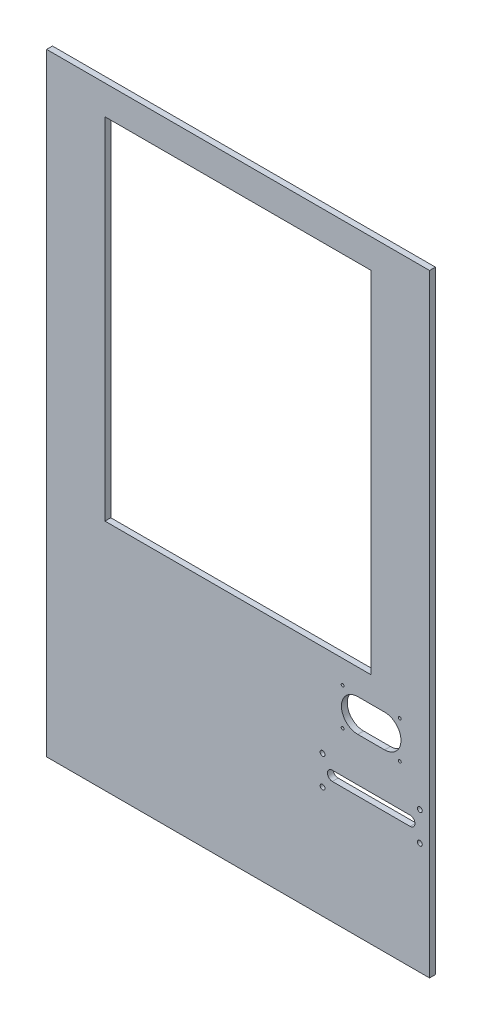
ISO-10303-21;
HEADER;
FILE_DESCRIPTION(('STEP AP214'),'2;1');
FILE_NAME('part.step','',(''),(''),'','','');
FILE_SCHEMA(('AUTOMOTIVE_DESIGN { 1 0 10303 214 1 1 1 1 }'));
ENDSEC;
DATA;
#1=APPLICATION_CONTEXT('core data for automotive mechanical design processes');
#2=APPLICATION_PROTOCOL_DEFINITION('international standard','automotive_design',2000,#1);
#3=PRODUCT_CONTEXT('',#1,'mechanical');
#4=PRODUCT('Part','Part','',(#3));
#5=PRODUCT_RELATED_PRODUCT_CATEGORY('part','',(#4));
#6=PRODUCT_DEFINITION_FORMATION('','',#4);
#7=PRODUCT_DEFINITION_CONTEXT('part definition',#1,'design');
#8=PRODUCT_DEFINITION('design','',#6,#7);
#9=PRODUCT_DEFINITION_SHAPE('','',#8);
#10=(LENGTH_UNIT() NAMED_UNIT(*) SI_UNIT(.MILLI.,.METRE.));
#11=(NAMED_UNIT(*) PLANE_ANGLE_UNIT() SI_UNIT($,.RADIAN.));
#12=(NAMED_UNIT(*) SI_UNIT($,.STERADIAN.) SOLID_ANGLE_UNIT());
#13=UNCERTAINTY_MEASURE_WITH_UNIT(LENGTH_MEASURE(1.E-05),#10,'distance_accuracy_value','');
#14=(GEOMETRIC_REPRESENTATION_CONTEXT(3) GLOBAL_UNCERTAINTY_ASSIGNED_CONTEXT((#13)) GLOBAL_UNIT_ASSIGNED_CONTEXT((#10,
#11,#12)) REPRESENTATION_CONTEXT('',''));
#15=CARTESIAN_POINT('',(0.,0.,0.));
#16=DIRECTION('',(0.,0.,1.));
#17=DIRECTION('',(1.,0.,0.));
#18=AXIS2_PLACEMENT_3D('',#15,#16,#17);
#19=CARTESIAN_POINT('',(0.,0.,7.62));
#20=DIRECTION('',(0.,0.,1.));
#21=DIRECTION('',(1.,0.,0.));
#22=AXIS2_PLACEMENT_3D('',#19,#20,#21);
#23=PLANE('',#22);
#24=CARTESIAN_POINT('',(237.3,-253.95,7.62));
#25=DIRECTION('',(0.,0.,1.));
#26=DIRECTION('',(-1.,0.,0.));
#27=AXIS2_PLACEMENT_3D('',#24,#25,#26);
#28=CIRCLE('',#27,3.175);
#29=CARTESIAN_POINT('',(234.125,-253.95,7.62));
#30=VERTEX_POINT('',#29);
#31=EDGE_CURVE('E562',#30,#30,#28,.T.);
#32=ORIENTED_EDGE('',*,*,#31,.F.);
#33=EDGE_LOOP('',(#32));
#34=FACE_BOUND('',#33,.T.);
#35=CARTESIAN_POINT('',(237.3,-215.85,7.62));
#36=DIRECTION('',(0.,0.,1.));
#37=DIRECTION('',(1.,0.,0.));
#38=AXIS2_PLACEMENT_3D('',#35,#36,#37);
#39=CIRCLE('',#38,3.175);
#40=CARTESIAN_POINT('',(240.475,-215.85,7.62));
#41=VERTEX_POINT('',#40);
#42=EDGE_CURVE('E175',#41,#41,#39,.T.);
#43=ORIENTED_EDGE('',*,*,#42,.F.);
#44=EDGE_LOOP('',(#43));
#45=FACE_BOUND('',#44,.T.);
#46=CARTESIAN_POINT('',(211.138,-174.448,7.62));
#47=DIRECTION('',(0.,0.,1.));
#48=DIRECTION('',(1.,0.,0.));
#49=AXIS2_PLACEMENT_3D('',#46,#47,#48);
#50=CIRCLE('',#49,1.90499999999999);
#51=CARTESIAN_POINT('',(213.043,-174.448,7.62));
#52=VERTEX_POINT('',#51);
#53=EDGE_CURVE('E191',#52,#52,#50,.T.);
#54=ORIENTED_EDGE('',*,*,#53,.F.);
#55=EDGE_LOOP('',(#54));
#56=FACE_BOUND('',#55,.T.);
#57=CARTESIAN_POINT('',(136.462,-125.68,7.62));
#58=DIRECTION('',(0.,0.,1.));
#59=DIRECTION('',(1.,0.,0.));
#60=AXIS2_PLACEMENT_3D('',#57,#58,#59);
#61=CIRCLE('',#60,1.90499999999999);
#62=CARTESIAN_POINT('',(138.367,-125.68,7.62));
#63=VERTEX_POINT('',#62);
#64=EDGE_CURVE('E203',#63,#63,#61,.T.);
#65=ORIENTED_EDGE('',*,*,#64,.F.);
#66=EDGE_LOOP('',(#65));
#67=FACE_BOUND('',#66,.T.);
#68=DIRECTION('',(0.,1.,0.));
#69=VECTOR('',#68,1.);
#70=CARTESIAN_POINT('',(250.,400.,7.62));
#71=LINE('',#70,#69);
#72=CARTESIAN_POINT('',(250.,-400.,7.62));
#73=VERTEX_POINT('',#72);
#74=CARTESIAN_POINT('',(250.,400.,7.62));
#75=VERTEX_POINT('',#74);
#76=EDGE_CURVE('E271',#73,#75,#71,.T.);
#77=ORIENTED_EDGE('',*,*,#76,.T.);
#78=DIRECTION('',(-1.,0.,0.));
#79=VECTOR('',#78,1.);
#80=CARTESIAN_POINT('',(-250.,400.,7.62));
#81=LINE('',#80,#79);
#82=CARTESIAN_POINT('',(-250.,400.,7.62));
#83=VERTEX_POINT('',#82);
#84=EDGE_CURVE('E274',#75,#83,#81,.T.);
#85=ORIENTED_EDGE('',*,*,#84,.T.);
#86=DIRECTION('',(0.,-1.,0.));
#87=VECTOR('',#86,1.);
#88=CARTESIAN_POINT('',(-250.,400.,7.62));
#89=LINE('',#88,#87);
#90=CARTESIAN_POINT('',(-250.,-400.,7.62));
#91=VERTEX_POINT('',#90);
#92=EDGE_CURVE('E277',#83,#91,#89,.T.);
#93=ORIENTED_EDGE('',*,*,#92,.T.);
#94=DIRECTION('',(1.,0.,0.));
#95=VECTOR('',#94,1.);
#96=CARTESIAN_POINT('',(-250.,-400.,7.62));
#97=LINE('',#96,#95);
#98=EDGE_CURVE('E279',#91,#73,#97,.T.);
#99=ORIENTED_EDGE('',*,*,#98,.T.);
#100=EDGE_LOOP('',(#77,#85,#93,#99));
#101=FACE_BOUND('',#100,.T.);
#102=DIRECTION('',(-1.,0.,0.));
#103=VECTOR('',#102,1.);
#104=CARTESIAN_POINT('',(-173.8,361.9,7.62));
#105=LINE('',#104,#103);
#106=CARTESIAN_POINT('',(173.8,361.9,7.62));
#107=VERTEX_POINT('',#106);
#108=CARTESIAN_POINT('',(-173.8,361.9,7.62));
#109=VERTEX_POINT('',#108);
#110=EDGE_CURVE('E242',#107,#109,#105,.T.);
#111=ORIENTED_EDGE('',*,*,#110,.F.);
#112=DIRECTION('',(0.,1.,0.));
#113=VECTOR('',#112,1.);
#114=CARTESIAN_POINT('',(173.8,361.9,7.62));
#115=LINE('',#114,#113);
#116=CARTESIAN_POINT('',(173.8,-95.3000000000001,7.62));
#117=VERTEX_POINT('',#116);
#118=EDGE_CURVE('E240',#117,#107,#115,.T.);
#119=ORIENTED_EDGE('',*,*,#118,.F.);
#120=DIRECTION('',(1.,0.,0.));
#121=VECTOR('',#120,1.);
#122=CARTESIAN_POINT('',(-173.8,-95.3000000000001,7.62));
#123=LINE('',#122,#121);
#124=CARTESIAN_POINT('',(-173.8,-95.3000000000001,7.62));
#125=VERTEX_POINT('',#124);
#126=EDGE_CURVE('E248',#125,#117,#123,.T.);
#127=ORIENTED_EDGE('',*,*,#126,.F.);
#128=DIRECTION('',(0.,-1.,0.));
#129=VECTOR('',#128,1.);
#130=CARTESIAN_POINT('',(-173.8,361.9,7.62));
#131=LINE('',#130,#129);
#132=EDGE_CURVE('E245',#109,#125,#131,.T.);
#133=ORIENTED_EDGE('',*,*,#132,.F.);
#134=EDGE_LOOP('',(#111,#119,#127,#133));
#135=FACE_BOUND('',#134,.T.);
#136=DIRECTION('',(-1.,0.,0.));
#137=VECTOR('',#136,1.);
#138=CARTESIAN_POINT('',(156.274,-128.728,7.62));
#139=LINE('',#138,#137);
#140=CARTESIAN_POINT('',(191.326,-128.728,7.62));
#141=VERTEX_POINT('',#140);
#142=CARTESIAN_POINT('',(156.274,-128.728,7.62));
#143=VERTEX_POINT('',#142);
#144=EDGE_CURVE('E211',#141,#143,#139,.T.);
#145=ORIENTED_EDGE('',*,*,#144,.F.);
#146=CARTESIAN_POINT('',(191.326,-150.064,7.62));
#147=DIRECTION('',(0.,0.,1.));
#148=DIRECTION('',(-1.,0.,0.));
#149=AXIS2_PLACEMENT_3D('',#146,#147,#148);
#150=CIRCLE('',#149,21.336);
#151=CARTESIAN_POINT('',(191.326,-171.4,7.62));
#152=VERTEX_POINT('',#151);
#153=EDGE_CURVE('E209',#152,#141,#150,.T.);
#154=ORIENTED_EDGE('',*,*,#153,.F.);
#155=DIRECTION('',(1.,0.,0.));
#156=VECTOR('',#155,1.);
#157=CARTESIAN_POINT('',(156.274,-171.4,7.62));
#158=LINE('',#157,#156);
#159=CARTESIAN_POINT('',(156.274,-171.4,7.62));
#160=VERTEX_POINT('',#159);
#161=EDGE_CURVE('E217',#160,#152,#158,.T.);
#162=ORIENTED_EDGE('',*,*,#161,.F.);
#163=CARTESIAN_POINT('',(156.274,-150.064,7.62));
#164=DIRECTION('',(0.,0.,1.));
#165=DIRECTION('',(1.,0.,0.));
#166=AXIS2_PLACEMENT_3D('',#163,#164,#165);
#167=CIRCLE('',#166,21.336);
#168=EDGE_CURVE('E214',#143,#160,#167,.T.);
#169=ORIENTED_EDGE('',*,*,#168,.F.);
#170=EDGE_LOOP('',(#145,#154,#162,#169));
#171=FACE_BOUND('',#170,.T.);
#172=CARTESIAN_POINT('',(211.138,-125.68,7.62));
#173=DIRECTION('',(0.,0.,1.));
#174=DIRECTION('',(-1.,0.,0.));
#175=AXIS2_PLACEMENT_3D('',#172,#173,#174);
#176=CIRCLE('',#175,1.90499999999999);
#177=CARTESIAN_POINT('',(209.233,-125.68,7.62));
#178=VERTEX_POINT('',#177);
#179=EDGE_CURVE('E197',#178,#178,#176,.T.);
#180=ORIENTED_EDGE('',*,*,#179,.F.);
#181=EDGE_LOOP('',(#180));
#182=FACE_BOUND('',#181,.T.);
#183=CARTESIAN_POINT('',(136.462,-174.448,7.62));
#184=DIRECTION('',(0.,0.,1.));
#185=DIRECTION('',(-1.,0.,0.));
#186=AXIS2_PLACEMENT_3D('',#183,#184,#185);
#187=CIRCLE('',#186,1.90499999999999);
#188=CARTESIAN_POINT('',(134.557,-174.448,7.62));
#189=VERTEX_POINT('',#188);
#190=EDGE_CURVE('E185',#189,#189,#187,.T.);
#191=ORIENTED_EDGE('',*,*,#190,.F.);
#192=EDGE_LOOP('',(#191));
#193=FACE_BOUND('',#192,.T.);
#194=DIRECTION('',(-1.,0.,0.));
#195=VECTOR('',#194,1.);
#196=CARTESIAN_POINT('',(224.6,-228.55,7.62));
#197=LINE('',#196,#195);
#198=CARTESIAN_POINT('',(224.6,-228.55,7.62));
#199=VERTEX_POINT('',#198);
#200=CARTESIAN_POINT('',(123.,-228.55,7.62));
#201=VERTEX_POINT('',#200);
#202=EDGE_CURVE('E154',#199,#201,#197,.T.);
#203=ORIENTED_EDGE('',*,*,#202,.F.);
#204=CARTESIAN_POINT('',(224.6,-234.9,7.62));
#205=DIRECTION('',(0.,0.,1.));
#206=DIRECTION('',(1.,0.,0.));
#207=AXIS2_PLACEMENT_3D('',#204,#205,#206);
#208=CIRCLE('',#207,6.35000000000002);
#209=CARTESIAN_POINT('',(224.6,-241.25,7.62));
#210=VERTEX_POINT('',#209);
#211=EDGE_CURVE('E146',#210,#199,#208,.T.);
#212=ORIENTED_EDGE('',*,*,#211,.F.);
#213=DIRECTION('',(1.,0.,0.));
#214=VECTOR('',#213,1.);
#215=CARTESIAN_POINT('',(224.6,-241.25,7.62));
#216=LINE('',#215,#214);
#217=CARTESIAN_POINT('',(123.,-241.25,7.62));
#218=VERTEX_POINT('',#217);
#219=EDGE_CURVE('E169',#218,#210,#216,.T.);
#220=ORIENTED_EDGE('',*,*,#219,.F.);
#221=CARTESIAN_POINT('',(123.,-234.9,7.62));
#222=DIRECTION('',(0.,0.,1.));
#223=DIRECTION('',(1.,0.,0.));
#224=AXIS2_PLACEMENT_3D('',#221,#222,#223);
#225=CIRCLE('',#224,6.34999999999998);
#226=EDGE_CURVE('E167',#201,#218,#225,.T.);
#227=ORIENTED_EDGE('',*,*,#226,.F.);
#228=EDGE_LOOP('',(#203,#212,#220,#227));
#229=FACE_BOUND('',#228,.T.);
#230=CARTESIAN_POINT('',(110.3,-215.85,7.62));
#231=DIRECTION('',(0.,0.,1.));
#232=DIRECTION('',(-1.,0.,0.));
#233=AXIS2_PLACEMENT_3D('',#230,#231,#232);
#234=CIRCLE('',#233,3.175);
#235=CARTESIAN_POINT('',(107.125,-215.85,7.62));
#236=VERTEX_POINT('',#235);
#237=EDGE_CURVE('E568',#236,#236,#234,.T.);
#238=ORIENTED_EDGE('',*,*,#237,.F.);
#239=EDGE_LOOP('',(#238));
#240=FACE_BOUND('',#239,.T.);
#241=CARTESIAN_POINT('',(110.3,-253.95,7.62));
#242=DIRECTION('',(0.,0.,1.));
#243=DIRECTION('',(1.,0.,0.));
#244=AXIS2_PLACEMENT_3D('',#241,#242,#243);
#245=CIRCLE('',#244,3.175);
#246=CARTESIAN_POINT('',(113.475,-253.95,7.62));
#247=VERTEX_POINT('',#246);
#248=EDGE_CURVE('E553',#247,#247,#245,.T.);
#249=ORIENTED_EDGE('',*,*,#248,.F.);
#250=EDGE_LOOP('',(#249));
#251=FACE_BOUND('',#250,.T.);
#252=ADVANCED_FACE('F33',(#34,#45,#56,#67,#101,#135,#171,#182,#193,#229,#240,#251),#23,.T.);
#253=CARTESIAN_POINT('',(0.,0.,0.));
#254=DIRECTION('',(0.,0.,1.));
#255=DIRECTION('',(1.,0.,0.));
#256=AXIS2_PLACEMENT_3D('',#253,#254,#255);
#257=PLANE('',#256);
#258=CARTESIAN_POINT('',(136.462,-174.448,0.));
#259=DIRECTION('',(0.,0.,1.));
#260=DIRECTION('',(-1.,0.,0.));
#261=AXIS2_PLACEMENT_3D('',#258,#259,#260);
#262=CIRCLE('',#261,1.90499999999999);
#263=CARTESIAN_POINT('',(134.557,-174.448,0.));
#264=VERTEX_POINT('',#263);
#265=EDGE_CURVE('E162',#264,#264,#262,.T.);
#266=ORIENTED_EDGE('',*,*,#265,.T.);
#267=EDGE_LOOP('',(#266));
#268=FACE_BOUND('',#267,.T.);
#269=CARTESIAN_POINT('',(211.138,-174.448,0.));
#270=DIRECTION('',(0.,0.,1.));
#271=DIRECTION('',(1.,0.,0.));
#272=AXIS2_PLACEMENT_3D('',#269,#270,#271);
#273=CIRCLE('',#272,1.90499999999999);
#274=CARTESIAN_POINT('',(213.043,-174.448,0.));
#275=VERTEX_POINT('',#274);
#276=EDGE_CURVE('E188',#275,#275,#273,.T.);
#277=ORIENTED_EDGE('',*,*,#276,.T.);
#278=EDGE_LOOP('',(#277));
#279=FACE_BOUND('',#278,.T.);
#280=CARTESIAN_POINT('',(211.138,-125.68,0.));
#281=DIRECTION('',(0.,0.,1.));
#282=DIRECTION('',(-1.,0.,0.));
#283=AXIS2_PLACEMENT_3D('',#280,#281,#282);
#284=CIRCLE('',#283,1.90499999999999);
#285=CARTESIAN_POINT('',(209.233,-125.68,0.));
#286=VERTEX_POINT('',#285);
#287=EDGE_CURVE('E194',#286,#286,#284,.T.);
#288=ORIENTED_EDGE('',*,*,#287,.T.);
#289=EDGE_LOOP('',(#288));
#290=FACE_BOUND('',#289,.T.);
#291=CARTESIAN_POINT('',(136.462,-125.68,0.));
#292=DIRECTION('',(0.,0.,1.));
#293=DIRECTION('',(1.,0.,0.));
#294=AXIS2_PLACEMENT_3D('',#291,#292,#293);
#295=CIRCLE('',#294,1.90499999999999);
#296=CARTESIAN_POINT('',(138.367,-125.68,0.));
#297=VERTEX_POINT('',#296);
#298=EDGE_CURVE('E200',#297,#297,#295,.T.);
#299=ORIENTED_EDGE('',*,*,#298,.T.);
#300=EDGE_LOOP('',(#299));
#301=FACE_BOUND('',#300,.T.);
#302=CARTESIAN_POINT('',(191.326,-150.064,0.));
#303=DIRECTION('',(0.,0.,1.));
#304=DIRECTION('',(-1.,0.,0.));
#305=AXIS2_PLACEMENT_3D('',#302,#303,#304);
#306=CIRCLE('',#305,21.336);
#307=CARTESIAN_POINT('',(191.326,-171.4,0.));
#308=VERTEX_POINT('',#307);
#309=CARTESIAN_POINT('',(191.326,-128.728,0.));
#310=VERTEX_POINT('',#309);
#311=EDGE_CURVE('E206',#308,#310,#306,.T.);
#312=ORIENTED_EDGE('',*,*,#311,.T.);
#313=DIRECTION('',(-1.,0.,0.));
#314=VECTOR('',#313,1.);
#315=CARTESIAN_POINT('',(156.274,-128.728,0.));
#316=LINE('',#315,#314);
#317=CARTESIAN_POINT('',(156.274,-128.728,0.));
#318=VERTEX_POINT('',#317);
#319=EDGE_CURVE('E222',#310,#318,#316,.T.);
#320=ORIENTED_EDGE('',*,*,#319,.T.);
#321=CARTESIAN_POINT('',(156.274,-150.064,0.));
#322=DIRECTION('',(0.,0.,1.));
#323=DIRECTION('',(1.,0.,0.));
#324=AXIS2_PLACEMENT_3D('',#321,#322,#323);
#325=CIRCLE('',#324,21.336);
#326=CARTESIAN_POINT('',(156.274,-171.4,0.));
#327=VERTEX_POINT('',#326);
#328=EDGE_CURVE('E225',#318,#327,#325,.T.);
#329=ORIENTED_EDGE('',*,*,#328,.T.);
#330=DIRECTION('',(1.,0.,0.));
#331=VECTOR('',#330,1.);
#332=CARTESIAN_POINT('',(156.274,-171.4,0.));
#333=LINE('',#332,#331);
#334=EDGE_CURVE('E212',#327,#308,#333,.T.);
#335=ORIENTED_EDGE('',*,*,#334,.T.);
#336=EDGE_LOOP('',(#312,#320,#329,#335));
#337=FACE_BOUND('',#336,.T.);
#338=DIRECTION('',(0.,1.,0.));
#339=VECTOR('',#338,1.);
#340=CARTESIAN_POINT('',(250.,400.,0.));
#341=LINE('',#340,#339);
#342=CARTESIAN_POINT('',(250.,-400.,0.));
#343=VERTEX_POINT('',#342);
#344=CARTESIAN_POINT('',(250.,400.,0.));
#345=VERTEX_POINT('',#344);
#346=EDGE_CURVE('E270',#343,#345,#341,.T.);
#347=ORIENTED_EDGE('',*,*,#346,.F.);
#348=DIRECTION('',(1.,0.,0.));
#349=VECTOR('',#348,1.);
#350=CARTESIAN_POINT('',(-250.,-400.,0.));
#351=LINE('',#350,#349);
#352=CARTESIAN_POINT('',(-250.,-400.,0.));
#353=VERTEX_POINT('',#352);
#354=EDGE_CURVE('E275',#353,#343,#351,.T.);
#355=ORIENTED_EDGE('',*,*,#354,.F.);
#356=DIRECTION('',(0.,-1.,0.));
#357=VECTOR('',#356,1.);
#358=CARTESIAN_POINT('',(-250.,400.,0.));
#359=LINE('',#358,#357);
#360=CARTESIAN_POINT('',(-250.,400.,0.));
#361=VERTEX_POINT('',#360);
#362=EDGE_CURVE('E286',#361,#353,#359,.T.);
#363=ORIENTED_EDGE('',*,*,#362,.F.);
#364=DIRECTION('',(-1.,0.,0.));
#365=VECTOR('',#364,1.);
#366=CARTESIAN_POINT('',(-250.,400.,0.));
#367=LINE('',#366,#365);
#368=EDGE_CURVE('E284',#345,#361,#367,.T.);
#369=ORIENTED_EDGE('',*,*,#368,.F.);
#370=EDGE_LOOP('',(#347,#355,#363,#369));
#371=FACE_BOUND('',#370,.T.);
#372=DIRECTION('',(0.,1.,0.));
#373=VECTOR('',#372,1.);
#374=CARTESIAN_POINT('',(173.8,361.9,0.));
#375=LINE('',#374,#373);
#376=CARTESIAN_POINT('',(173.8,-95.3000000000001,0.));
#377=VERTEX_POINT('',#376);
#378=CARTESIAN_POINT('',(173.8,361.9,0.));
#379=VERTEX_POINT('',#378);
#380=EDGE_CURVE('E239',#377,#379,#375,.T.);
#381=ORIENTED_EDGE('',*,*,#380,.T.);
#382=DIRECTION('',(-1.,0.,0.));
#383=VECTOR('',#382,1.);
#384=CARTESIAN_POINT('',(-173.8,361.9,0.));
#385=LINE('',#384,#383);
#386=CARTESIAN_POINT('',(-173.8,361.9,0.));
#387=VERTEX_POINT('',#386);
#388=EDGE_CURVE('E253',#379,#387,#385,.T.);
#389=ORIENTED_EDGE('',*,*,#388,.T.);
#390=DIRECTION('',(0.,-1.,0.));
#391=VECTOR('',#390,1.);
#392=CARTESIAN_POINT('',(-173.8,361.9,0.));
#393=LINE('',#392,#391);
#394=CARTESIAN_POINT('',(-173.8,-95.3000000000001,0.));
#395=VERTEX_POINT('',#394);
#396=EDGE_CURVE('E256',#387,#395,#393,.T.);
#397=ORIENTED_EDGE('',*,*,#396,.T.);
#398=DIRECTION('',(1.,0.,0.));
#399=VECTOR('',#398,1.);
#400=CARTESIAN_POINT('',(-173.8,-95.3000000000001,0.));
#401=LINE('',#400,#399);
#402=EDGE_CURVE('E243',#395,#377,#401,.T.);
#403=ORIENTED_EDGE('',*,*,#402,.T.);
#404=EDGE_LOOP('',(#381,#389,#397,#403));
#405=FACE_BOUND('',#404,.T.);
#406=CARTESIAN_POINT('',(224.6,-234.9,0.));
#407=DIRECTION('',(0.,0.,1.));
#408=DIRECTION('',(1.,0.,0.));
#409=AXIS2_PLACEMENT_3D('',#406,#407,#408);
#410=CIRCLE('',#409,6.35000000000002);
#411=CARTESIAN_POINT('',(224.6,-241.25,0.));
#412=VERTEX_POINT('',#411);
#413=CARTESIAN_POINT('',(224.6,-228.55,0.));
#414=VERTEX_POINT('',#413);
#415=EDGE_CURVE('E56',#412,#414,#410,.T.);
#416=ORIENTED_EDGE('',*,*,#415,.T.);
#417=DIRECTION('',(-1.,0.,0.));
#418=VECTOR('',#417,1.);
#419=CARTESIAN_POINT('',(224.6,-228.55,0.));
#420=LINE('',#419,#418);
#421=CARTESIAN_POINT('',(123.,-228.55,0.));
#422=VERTEX_POINT('',#421);
#423=EDGE_CURVE('E161',#414,#422,#420,.T.);
#424=ORIENTED_EDGE('',*,*,#423,.T.);
#425=CARTESIAN_POINT('',(123.,-234.9,0.));
#426=DIRECTION('',(0.,0.,1.));
#427=DIRECTION('',(1.,0.,0.));
#428=AXIS2_PLACEMENT_3D('',#425,#426,#427);
#429=CIRCLE('',#428,6.34999999999998);
#430=CARTESIAN_POINT('',(123.,-241.25,0.));
#431=VERTEX_POINT('',#430);
#432=EDGE_CURVE('E177',#422,#431,#429,.T.);
#433=ORIENTED_EDGE('',*,*,#432,.T.);
#434=DIRECTION('',(1.,0.,0.));
#435=VECTOR('',#434,1.);
#436=CARTESIAN_POINT('',(224.6,-241.25,0.));
#437=LINE('',#436,#435);
#438=EDGE_CURVE('E155',#431,#412,#437,.T.);
#439=ORIENTED_EDGE('',*,*,#438,.T.);
#440=EDGE_LOOP('',(#416,#424,#433,#439));
#441=FACE_BOUND('',#440,.T.);
#442=CARTESIAN_POINT('',(237.3,-215.85,0.));
#443=DIRECTION('',(0.,0.,1.));
#444=DIRECTION('',(1.,0.,0.));
#445=AXIS2_PLACEMENT_3D('',#442,#443,#444);
#446=CIRCLE('',#445,3.175);
#447=CARTESIAN_POINT('',(240.475,-215.85,0.));
#448=VERTEX_POINT('',#447);
#449=EDGE_CURVE('E571',#448,#448,#446,.T.);
#450=ORIENTED_EDGE('',*,*,#449,.T.);
#451=EDGE_LOOP('',(#450));
#452=FACE_BOUND('',#451,.T.);
#453=CARTESIAN_POINT('',(110.3,-215.85,0.));
#454=DIRECTION('',(0.,0.,1.));
#455=DIRECTION('',(-1.,0.,0.));
#456=AXIS2_PLACEMENT_3D('',#453,#454,#455);
#457=CIRCLE('',#456,3.175);
#458=CARTESIAN_POINT('',(107.125,-215.85,0.));
#459=VERTEX_POINT('',#458);
#460=EDGE_CURVE('E565',#459,#459,#457,.T.);
#461=ORIENTED_EDGE('',*,*,#460,.T.);
#462=EDGE_LOOP('',(#461));
#463=FACE_BOUND('',#462,.T.);
#464=CARTESIAN_POINT('',(237.3,-253.95,0.));
#465=DIRECTION('',(0.,0.,1.));
#466=DIRECTION('',(-1.,0.,0.));
#467=AXIS2_PLACEMENT_3D('',#464,#465,#466);
#468=CIRCLE('',#467,3.175);
#469=CARTESIAN_POINT('',(234.125,-253.95,0.));
#470=VERTEX_POINT('',#469);
#471=EDGE_CURVE('E559',#470,#470,#468,.T.);
#472=ORIENTED_EDGE('',*,*,#471,.T.);
#473=EDGE_LOOP('',(#472));
#474=FACE_BOUND('',#473,.T.);
#475=CARTESIAN_POINT('',(110.3,-253.95,0.));
#476=DIRECTION('',(0.,0.,1.));
#477=DIRECTION('',(1.,0.,0.));
#478=AXIS2_PLACEMENT_3D('',#475,#476,#477);
#479=CIRCLE('',#478,3.175);
#480=CARTESIAN_POINT('',(113.475,-253.95,0.));
#481=VERTEX_POINT('',#480);
#482=EDGE_CURVE('E556',#481,#481,#479,.T.);
#483=ORIENTED_EDGE('',*,*,#482,.T.);
#484=EDGE_LOOP('',(#483));
#485=FACE_BOUND('',#484,.T.);
#486=ADVANCED_FACE('F304',(#268,#279,#290,#301,#337,#371,#405,#441,#452,#463,#474,#485),#257,.F.);
#487=CARTESIAN_POINT('',(250.,400.,7.62));
#488=DIRECTION('',(-1.,0.,0.));
#489=DIRECTION('',(0.,-1.,0.));
#490=AXIS2_PLACEMENT_3D('',#487,#488,#489);
#491=PLANE('',#490);
#492=ORIENTED_EDGE('',*,*,#346,.T.);
#493=DIRECTION('',(0.,0.,-1.));
#494=VECTOR('',#493,1.);
#495=CARTESIAN_POINT('',(250.,400.,7.62));
#496=LINE('',#495,#494);
#497=EDGE_CURVE('E11',#75,#345,#496,.T.);
#498=ORIENTED_EDGE('',*,*,#497,.F.);
#499=ORIENTED_EDGE('',*,*,#76,.F.);
#500=DIRECTION('',(0.,0.,-1.));
#501=VECTOR('',#500,1.);
#502=CARTESIAN_POINT('',(250.,-400.,7.62));
#503=LINE('',#502,#501);
#504=EDGE_CURVE('E281',#73,#343,#503,.T.);
#505=ORIENTED_EDGE('',*,*,#504,.T.);
#506=EDGE_LOOP('',(#492,#498,#499,#505));
#507=FACE_BOUND('',#506,.T.);
#508=ADVANCED_FACE('F35',(#507),#491,.F.);
#509=CARTESIAN_POINT('',(-250.,400.,7.62));
#510=DIRECTION('',(0.,-1.,0.));
#511=DIRECTION('',(0.,0.,-1.));
#512=AXIS2_PLACEMENT_3D('',#509,#510,#511);
#513=PLANE('',#512);
#514=ORIENTED_EDGE('',*,*,#368,.T.);
#515=DIRECTION('',(0.,0.,-1.));
#516=VECTOR('',#515,1.);
#517=CARTESIAN_POINT('',(-250.,400.,7.62));
#518=LINE('',#517,#516);
#519=EDGE_CURVE('E41',#83,#361,#518,.T.);
#520=ORIENTED_EDGE('',*,*,#519,.F.);
#521=ORIENTED_EDGE('',*,*,#84,.F.);
#522=ORIENTED_EDGE('',*,*,#497,.T.);
#523=EDGE_LOOP('',(#514,#520,#521,#522));
#524=FACE_BOUND('',#523,.T.);
#525=ADVANCED_FACE('F315',(#524),#513,.F.);
#526=CARTESIAN_POINT('',(-250.,400.,7.62));
#527=DIRECTION('',(1.,0.,0.));
#528=DIRECTION('',(0.,1.,0.));
#529=AXIS2_PLACEMENT_3D('',#526,#527,#528);
#530=PLANE('',#529);
#531=ORIENTED_EDGE('',*,*,#362,.T.);
#532=DIRECTION('',(0.,0.,-1.));
#533=VECTOR('',#532,1.);
#534=CARTESIAN_POINT('',(-250.,-400.,7.62));
#535=LINE('',#534,#533);
#536=EDGE_CURVE('E291',#91,#353,#535,.T.);
#537=ORIENTED_EDGE('',*,*,#536,.F.);
#538=ORIENTED_EDGE('',*,*,#92,.F.);
#539=ORIENTED_EDGE('',*,*,#519,.T.);
#540=EDGE_LOOP('',(#531,#537,#538,#539));
#541=FACE_BOUND('',#540,.T.);
#542=ADVANCED_FACE('F298',(#541),#530,.F.);
#543=CARTESIAN_POINT('',(-250.,-400.,7.62));
#544=DIRECTION('',(0.,1.,0.));
#545=DIRECTION('',(0.,0.,1.));
#546=AXIS2_PLACEMENT_3D('',#543,#544,#545);
#547=PLANE('',#546);
#548=ORIENTED_EDGE('',*,*,#354,.T.);
#549=ORIENTED_EDGE('',*,*,#504,.F.);
#550=ORIENTED_EDGE('',*,*,#98,.F.);
#551=ORIENTED_EDGE('',*,*,#536,.T.);
#552=EDGE_LOOP('',(#548,#549,#550,#551));
#553=FACE_BOUND('',#552,.T.);
#554=ADVANCED_FACE('F308',(#553),#547,.F.);
#555=CARTESIAN_POINT('',(173.8,361.9,7.62));
#556=DIRECTION('',(-1.,0.,0.));
#557=DIRECTION('',(0.,-1.,0.));
#558=AXIS2_PLACEMENT_3D('',#555,#556,#557);
#559=PLANE('',#558);
#560=ORIENTED_EDGE('',*,*,#380,.F.);
#561=DIRECTION('',(0.,0.,-1.));
#562=VECTOR('',#561,1.);
#563=CARTESIAN_POINT('',(173.8,-95.3000000000001,7.62));
#564=LINE('',#563,#562);
#565=EDGE_CURVE('E250',#117,#377,#564,.T.);
#566=ORIENTED_EDGE('',*,*,#565,.F.);
#567=ORIENTED_EDGE('',*,*,#118,.T.);
#568=DIRECTION('',(0.,0.,-1.));
#569=VECTOR('',#568,1.);
#570=CARTESIAN_POINT('',(173.8,361.9,7.62));
#571=LINE('',#570,#569);
#572=EDGE_CURVE('E267',#107,#379,#571,.T.);
#573=ORIENTED_EDGE('',*,*,#572,.T.);
#574=EDGE_LOOP('',(#560,#566,#567,#573));
#575=FACE_BOUND('',#574,.T.);
#576=ADVANCED_FACE('F333',(#575),#559,.T.);
#577=CARTESIAN_POINT('',(-173.8,361.9,7.62));
#578=DIRECTION('',(0.,-1.,0.));
#579=DIRECTION('',(0.,0.,-1.));
#580=AXIS2_PLACEMENT_3D('',#577,#578,#579);
#581=PLANE('',#580);
#582=ORIENTED_EDGE('',*,*,#388,.F.);
#583=ORIENTED_EDGE('',*,*,#572,.F.);
#584=ORIENTED_EDGE('',*,*,#110,.T.);
#585=DIRECTION('',(0.,0.,-1.));
#586=VECTOR('',#585,1.);
#587=CARTESIAN_POINT('',(-173.8,361.9,7.62));
#588=LINE('',#587,#586);
#589=EDGE_CURVE('E265',#109,#387,#588,.T.);
#590=ORIENTED_EDGE('',*,*,#589,.T.);
#591=EDGE_LOOP('',(#582,#583,#584,#590));
#592=FACE_BOUND('',#591,.T.);
#593=ADVANCED_FACE('F340',(#592),#581,.T.);
#594=CARTESIAN_POINT('',(-173.8,361.9,7.62));
#595=DIRECTION('',(1.,0.,0.));
#596=DIRECTION('',(0.,1.,0.));
#597=AXIS2_PLACEMENT_3D('',#594,#595,#596);
#598=PLANE('',#597);
#599=ORIENTED_EDGE('',*,*,#396,.F.);
#600=ORIENTED_EDGE('',*,*,#589,.F.);
#601=ORIENTED_EDGE('',*,*,#132,.T.);
#602=DIRECTION('',(0.,0.,-1.));
#603=VECTOR('',#602,1.);
#604=CARTESIAN_POINT('',(-173.8,-95.3000000000001,7.62));
#605=LINE('',#604,#603);
#606=EDGE_CURVE('E263',#125,#395,#605,.T.);
#607=ORIENTED_EDGE('',*,*,#606,.T.);
#608=EDGE_LOOP('',(#599,#600,#601,#607));
#609=FACE_BOUND('',#608,.T.);
#610=ADVANCED_FACE('F345',(#609),#598,.T.);
#611=CARTESIAN_POINT('',(-173.8,-95.3000000000001,7.62));
#612=DIRECTION('',(0.,1.,0.));
#613=DIRECTION('',(0.,0.,1.));
#614=AXIS2_PLACEMENT_3D('',#611,#612,#613);
#615=PLANE('',#614);
#616=ORIENTED_EDGE('',*,*,#402,.F.);
#617=ORIENTED_EDGE('',*,*,#606,.F.);
#618=ORIENTED_EDGE('',*,*,#126,.T.);
#619=ORIENTED_EDGE('',*,*,#565,.T.);
#620=EDGE_LOOP('',(#616,#617,#618,#619));
#621=FACE_BOUND('',#620,.T.);
#622=ADVANCED_FACE('F352',(#621),#615,.T.);
#623=CARTESIAN_POINT('',(191.326,-150.064,7.62));
#624=DIRECTION('',(0.,0.,-1.));
#625=DIRECTION('',(-1.,0.,0.));
#626=AXIS2_PLACEMENT_3D('',#623,#624,#625);
#627=CYLINDRICAL_SURFACE('',#626,21.336);
#628=ORIENTED_EDGE('',*,*,#311,.F.);
#629=DIRECTION('',(0.,0.,-1.));
#630=VECTOR('',#629,1.);
#631=CARTESIAN_POINT('',(191.326,-171.4,7.62));
#632=LINE('',#631,#630);
#633=EDGE_CURVE('E219',#152,#308,#632,.T.);
#634=ORIENTED_EDGE('',*,*,#633,.F.);
#635=ORIENTED_EDGE('',*,*,#153,.T.);
#636=DIRECTION('',(0.,0.,-1.));
#637=VECTOR('',#636,1.);
#638=CARTESIAN_POINT('',(191.326,-128.728,7.62));
#639=LINE('',#638,#637);
#640=EDGE_CURVE('E236',#141,#310,#639,.T.);
#641=ORIENTED_EDGE('',*,*,#640,.T.);
#642=EDGE_LOOP('',(#628,#634,#635,#641));
#643=FACE_BOUND('',#642,.T.);
#644=ADVANCED_FACE('F385',(#643),#627,.F.);
#645=CARTESIAN_POINT('',(156.274,-128.728,7.62));
#646=DIRECTION('',(0.,-1.,0.));
#647=DIRECTION('',(0.,0.,-1.));
#648=AXIS2_PLACEMENT_3D('',#645,#646,#647);
#649=PLANE('',#648);
#650=ORIENTED_EDGE('',*,*,#319,.F.);
#651=ORIENTED_EDGE('',*,*,#640,.F.);
#652=ORIENTED_EDGE('',*,*,#144,.T.);
#653=DIRECTION('',(0.,0.,-1.));
#654=VECTOR('',#653,1.);
#655=CARTESIAN_POINT('',(156.274,-128.728,7.62));
#656=LINE('',#655,#654);
#657=EDGE_CURVE('E234',#143,#318,#656,.T.);
#658=ORIENTED_EDGE('',*,*,#657,.T.);
#659=EDGE_LOOP('',(#650,#651,#652,#658));
#660=FACE_BOUND('',#659,.T.);
#661=ADVANCED_FACE('F391',(#660),#649,.T.);
#662=CARTESIAN_POINT('',(156.274,-150.064,7.62));
#663=DIRECTION('',(0.,0.,-1.));
#664=DIRECTION('',(-1.,0.,0.));
#665=AXIS2_PLACEMENT_3D('',#662,#663,#664);
#666=CYLINDRICAL_SURFACE('',#665,21.336);
#667=ORIENTED_EDGE('',*,*,#328,.F.);
#668=ORIENTED_EDGE('',*,*,#657,.F.);
#669=ORIENTED_EDGE('',*,*,#168,.T.);
#670=DIRECTION('',(0.,0.,-1.));
#671=VECTOR('',#670,1.);
#672=CARTESIAN_POINT('',(156.274,-171.4,7.62));
#673=LINE('',#672,#671);
#674=EDGE_CURVE('E232',#160,#327,#673,.T.);
#675=ORIENTED_EDGE('',*,*,#674,.T.);
#676=EDGE_LOOP('',(#667,#668,#669,#675));
#677=FACE_BOUND('',#676,.T.);
#678=ADVANCED_FACE('F395',(#677),#666,.F.);
#679=CARTESIAN_POINT('',(156.274,-171.4,7.62));
#680=DIRECTION('',(0.,1.,0.));
#681=DIRECTION('',(0.,0.,1.));
#682=AXIS2_PLACEMENT_3D('',#679,#680,#681);
#683=PLANE('',#682);
#684=ORIENTED_EDGE('',*,*,#334,.F.);
#685=ORIENTED_EDGE('',*,*,#674,.F.);
#686=ORIENTED_EDGE('',*,*,#161,.T.);
#687=ORIENTED_EDGE('',*,*,#633,.T.);
#688=EDGE_LOOP('',(#684,#685,#686,#687));
#689=FACE_BOUND('',#688,.T.);
#690=ADVANCED_FACE('F388',(#689),#683,.T.);
#691=CARTESIAN_POINT('',(136.462,-125.68,7.62));
#692=DIRECTION('',(0.,0.,-1.));
#693=DIRECTION('',(-1.,0.,0.));
#694=AXIS2_PLACEMENT_3D('',#691,#692,#693);
#695=CYLINDRICAL_SURFACE('',#694,1.90499999999999);
#696=ORIENTED_EDGE('',*,*,#64,.T.);
#697=EDGE_LOOP('',(#696));
#698=FACE_BOUND('',#697,.T.);
#699=ORIENTED_EDGE('',*,*,#298,.F.);
#700=EDGE_LOOP('',(#699));
#701=FACE_BOUND('',#700,.T.);
#702=ADVANCED_FACE('F402',(#698,#701),#695,.F.);
#703=CARTESIAN_POINT('',(211.138,-125.68,7.62));
#704=DIRECTION('',(0.,0.,-1.));
#705=DIRECTION('',(-1.,0.,0.));
#706=AXIS2_PLACEMENT_3D('',#703,#704,#705);
#707=CYLINDRICAL_SURFACE('',#706,1.90499999999999);
#708=ORIENTED_EDGE('',*,*,#179,.T.);
#709=EDGE_LOOP('',(#708));
#710=FACE_BOUND('',#709,.T.);
#711=ORIENTED_EDGE('',*,*,#287,.F.);
#712=EDGE_LOOP('',(#711));
#713=FACE_BOUND('',#712,.T.);
#714=ADVANCED_FACE('F447',(#710,#713),#707,.F.);
#715=CARTESIAN_POINT('',(211.138,-174.448,7.62));
#716=DIRECTION('',(0.,0.,-1.));
#717=DIRECTION('',(-1.,0.,0.));
#718=AXIS2_PLACEMENT_3D('',#715,#716,#717);
#719=CYLINDRICAL_SURFACE('',#718,1.90499999999999);
#720=ORIENTED_EDGE('',*,*,#53,.T.);
#721=EDGE_LOOP('',(#720));
#722=FACE_BOUND('',#721,.T.);
#723=ORIENTED_EDGE('',*,*,#276,.F.);
#724=EDGE_LOOP('',(#723));
#725=FACE_BOUND('',#724,.T.);
#726=ADVANCED_FACE('F372',(#722,#725),#719,.F.);
#727=CARTESIAN_POINT('',(136.462,-174.448,7.62));
#728=DIRECTION('',(0.,0.,-1.));
#729=DIRECTION('',(-1.,0.,0.));
#730=AXIS2_PLACEMENT_3D('',#727,#728,#729);
#731=CYLINDRICAL_SURFACE('',#730,1.90499999999999);
#732=ORIENTED_EDGE('',*,*,#190,.T.);
#733=EDGE_LOOP('',(#732));
#734=FACE_BOUND('',#733,.T.);
#735=ORIENTED_EDGE('',*,*,#265,.F.);
#736=EDGE_LOOP('',(#735));
#737=FACE_BOUND('',#736,.T.);
#738=ADVANCED_FACE('F369',(#734,#737),#731,.F.);
#739=CARTESIAN_POINT('',(224.6,-234.9,7.62));
#740=DIRECTION('',(0.,0.,-1.));
#741=DIRECTION('',(-1.,0.,0.));
#742=AXIS2_PLACEMENT_3D('',#739,#740,#741);
#743=CYLINDRICAL_SURFACE('',#742,6.35000000000002);
#744=ORIENTED_EDGE('',*,*,#415,.F.);
#745=DIRECTION('',(0.,0.,-1.));
#746=VECTOR('',#745,1.);
#747=CARTESIAN_POINT('',(224.6,-241.25,7.62));
#748=LINE('',#747,#746);
#749=EDGE_CURVE('E150',#210,#412,#748,.T.);
#750=ORIENTED_EDGE('',*,*,#749,.F.);
#751=ORIENTED_EDGE('',*,*,#211,.T.);
#752=DIRECTION('',(0.,0.,-1.));
#753=VECTOR('',#752,1.);
#754=CARTESIAN_POINT('',(224.6,-228.55,7.62));
#755=LINE('',#754,#753);
#756=EDGE_CURVE('E149',#199,#414,#755,.T.);
#757=ORIENTED_EDGE('',*,*,#756,.T.);
#758=EDGE_LOOP('',(#744,#750,#751,#757));
#759=FACE_BOUND('',#758,.T.);
#760=ADVANCED_FACE('F148',(#759),#743,.F.);
#761=CARTESIAN_POINT('',(224.6,-228.55,7.62));
#762=DIRECTION('',(0.,-1.,0.));
#763=DIRECTION('',(1.,0.,0.));
#764=AXIS2_PLACEMENT_3D('',#761,#762,#763);
#765=PLANE('',#764);
#766=ORIENTED_EDGE('',*,*,#423,.F.);
#767=ORIENTED_EDGE('',*,*,#756,.F.);
#768=ORIENTED_EDGE('',*,*,#202,.T.);
#769=DIRECTION('',(0.,0.,-1.));
#770=VECTOR('',#769,1.);
#771=CARTESIAN_POINT('',(123.,-228.55,7.62));
#772=LINE('',#771,#770);
#773=EDGE_CURVE('E163',#201,#422,#772,.T.);
#774=ORIENTED_EDGE('',*,*,#773,.T.);
#775=EDGE_LOOP('',(#766,#767,#768,#774));
#776=FACE_BOUND('',#775,.T.);
#777=ADVANCED_FACE('F158',(#776),#765,.T.);
#778=CARTESIAN_POINT('',(123.,-234.9,7.62));
#779=DIRECTION('',(0.,0.,-1.));
#780=DIRECTION('',(-1.,0.,0.));
#781=AXIS2_PLACEMENT_3D('',#778,#779,#780);
#782=CYLINDRICAL_SURFACE('',#781,6.34999999999998);
#783=ORIENTED_EDGE('',*,*,#432,.F.);
#784=ORIENTED_EDGE('',*,*,#773,.F.);
#785=ORIENTED_EDGE('',*,*,#226,.T.);
#786=DIRECTION('',(0.,0.,-1.));
#787=VECTOR('',#786,1.);
#788=CARTESIAN_POINT('',(123.,-241.25,7.62));
#789=LINE('',#788,#787);
#790=EDGE_CURVE('E48',#218,#431,#789,.T.);
#791=ORIENTED_EDGE('',*,*,#790,.T.);
#792=EDGE_LOOP('',(#783,#784,#785,#791));
#793=FACE_BOUND('',#792,.T.);
#794=ADVANCED_FACE('F488',(#793),#782,.F.);
#795=CARTESIAN_POINT('',(224.6,-241.25,7.62));
#796=DIRECTION('',(0.,1.,0.));
#797=DIRECTION('',(-1.,0.,0.));
#798=AXIS2_PLACEMENT_3D('',#795,#796,#797);
#799=PLANE('',#798);
#800=ORIENTED_EDGE('',*,*,#438,.F.);
#801=ORIENTED_EDGE('',*,*,#790,.F.);
#802=ORIENTED_EDGE('',*,*,#219,.T.);
#803=ORIENTED_EDGE('',*,*,#749,.T.);
#804=EDGE_LOOP('',(#800,#801,#802,#803));
#805=FACE_BOUND('',#804,.T.);
#806=ADVANCED_FACE('F497',(#805),#799,.T.);
#807=CARTESIAN_POINT('',(237.3,-215.85,7.62));
#808=DIRECTION('',(0.,0.,-1.));
#809=DIRECTION('',(-1.,0.,0.));
#810=AXIS2_PLACEMENT_3D('',#807,#808,#809);
#811=CYLINDRICAL_SURFACE('',#810,3.175);
#812=ORIENTED_EDGE('',*,*,#42,.T.);
#813=EDGE_LOOP('',(#812));
#814=FACE_BOUND('',#813,.T.);
#815=ORIENTED_EDGE('',*,*,#449,.F.);
#816=EDGE_LOOP('',(#815));
#817=FACE_BOUND('',#816,.T.);
#818=ADVANCED_FACE('F507',(#814,#817),#811,.F.);
#819=CARTESIAN_POINT('',(110.3,-215.85,7.62));
#820=DIRECTION('',(0.,0.,-1.));
#821=DIRECTION('',(-1.,0.,0.));
#822=AXIS2_PLACEMENT_3D('',#819,#820,#821);
#823=CYLINDRICAL_SURFACE('',#822,3.175);
#824=ORIENTED_EDGE('',*,*,#237,.T.);
#825=EDGE_LOOP('',(#824));
#826=FACE_BOUND('',#825,.T.);
#827=ORIENTED_EDGE('',*,*,#460,.F.);
#828=EDGE_LOOP('',(#827));
#829=FACE_BOUND('',#828,.T.);
#830=ADVANCED_FACE('F516',(#826,#829),#823,.F.);
#831=CARTESIAN_POINT('',(237.3,-253.95,7.62));
#832=DIRECTION('',(0.,0.,-1.));
#833=DIRECTION('',(-1.,0.,0.));
#834=AXIS2_PLACEMENT_3D('',#831,#832,#833);
#835=CYLINDRICAL_SURFACE('',#834,3.175);
#836=ORIENTED_EDGE('',*,*,#31,.T.);
#837=EDGE_LOOP('',(#836));
#838=FACE_BOUND('',#837,.T.);
#839=ORIENTED_EDGE('',*,*,#471,.F.);
#840=EDGE_LOOP('',(#839));
#841=FACE_BOUND('',#840,.T.);
#842=ADVANCED_FACE('F526',(#838,#841),#835,.F.);
#843=CARTESIAN_POINT('',(110.3,-253.95,7.62));
#844=DIRECTION('',(0.,0.,-1.));
#845=DIRECTION('',(-1.,0.,0.));
#846=AXIS2_PLACEMENT_3D('',#843,#844,#845);
#847=CYLINDRICAL_SURFACE('',#846,3.175);
#848=ORIENTED_EDGE('',*,*,#248,.T.);
#849=EDGE_LOOP('',(#848));
#850=FACE_BOUND('',#849,.T.);
#851=ORIENTED_EDGE('',*,*,#482,.F.);
#852=EDGE_LOOP('',(#851));
#853=FACE_BOUND('',#852,.T.);
#854=ADVANCED_FACE('F536',(#850,#853),#847,.F.);
#855=CLOSED_SHELL('',(#252,#486,#508,#525,#542,#554,#576,#593,#610,#622,#644,#661,#678,#690,
#702,#714,#726,#738,#760,#777,#794,#806,#818,#830,#842,#854));
#856=MANIFOLD_SOLID_BREP('B2',#855);
#857=ADVANCED_BREP_SHAPE_REPRESENTATION('',(#18,#856),#14);
#858=SHAPE_DEFINITION_REPRESENTATION(#9,#857);
ENDSEC;
END-ISO-10303-21;
